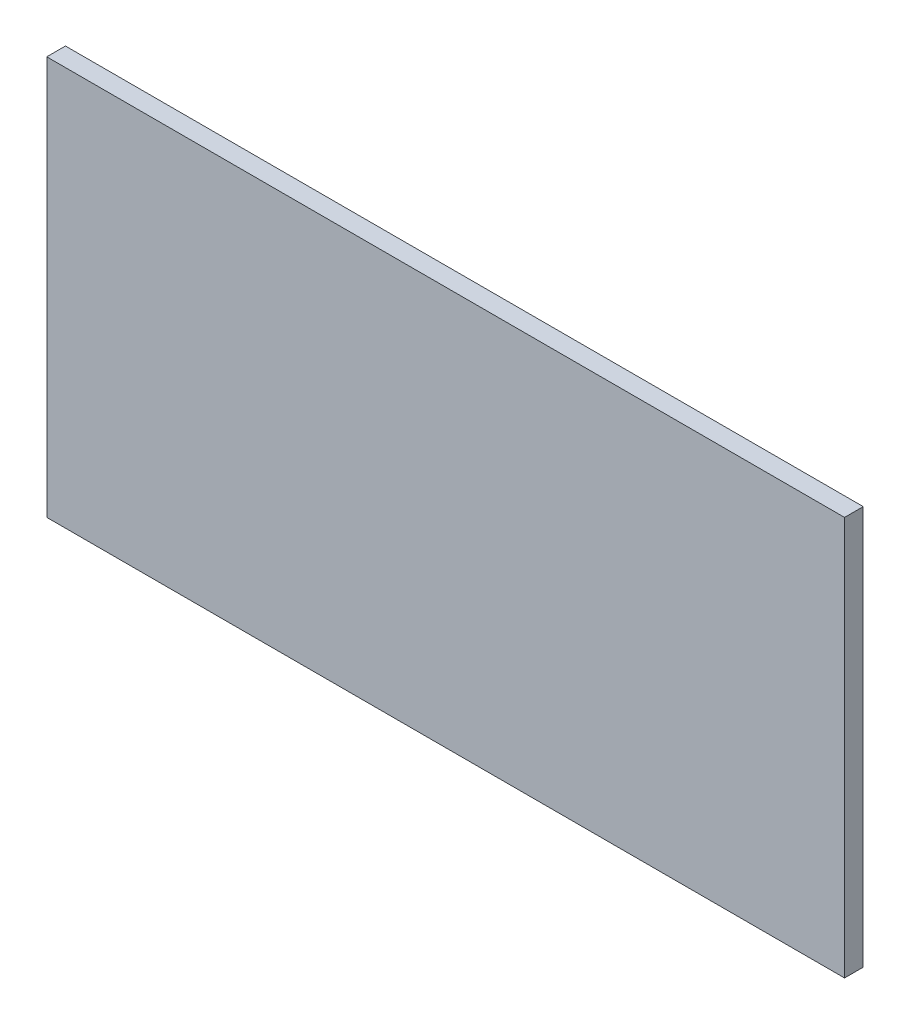
ISO-10303-21;
HEADER;
FILE_DESCRIPTION(('STEP AP214'),'2;1');
FILE_NAME('part.step','',(''),(''),'','','');
FILE_SCHEMA(('AUTOMOTIVE_DESIGN { 1 0 10303 214 1 1 1 1 }'));
ENDSEC;
DATA;
#1=APPLICATION_CONTEXT('core data for automotive mechanical design processes');
#2=APPLICATION_PROTOCOL_DEFINITION('international standard','automotive_design',2000,#1);
#3=PRODUCT_CONTEXT('',#1,'mechanical');
#4=PRODUCT('Part','Part','',(#3));
#5=PRODUCT_RELATED_PRODUCT_CATEGORY('part','',(#4));
#6=PRODUCT_DEFINITION_FORMATION('','',#4);
#7=PRODUCT_DEFINITION_CONTEXT('part definition',#1,'design');
#8=PRODUCT_DEFINITION('design','',#6,#7);
#9=PRODUCT_DEFINITION_SHAPE('','',#8);
#10=(LENGTH_UNIT() NAMED_UNIT(*) SI_UNIT(.MILLI.,.METRE.));
#11=(NAMED_UNIT(*) PLANE_ANGLE_UNIT() SI_UNIT($,.RADIAN.));
#12=(NAMED_UNIT(*) SI_UNIT($,.STERADIAN.) SOLID_ANGLE_UNIT());
#13=UNCERTAINTY_MEASURE_WITH_UNIT(LENGTH_MEASURE(1.E-05),#10,'distance_accuracy_value','');
#14=(GEOMETRIC_REPRESENTATION_CONTEXT(3) GLOBAL_UNCERTAINTY_ASSIGNED_CONTEXT((#13)) GLOBAL_UNIT_ASSIGNED_CONTEXT((#10,
#11,#12)) REPRESENTATION_CONTEXT('',''));
#15=CARTESIAN_POINT('',(0.,0.,0.));
#16=DIRECTION('',(0.,0.,1.));
#17=DIRECTION('',(1.,0.,0.));
#18=AXIS2_PLACEMENT_3D('',#15,#16,#17);
#19=CARTESIAN_POINT('',(64.,32.,3.));
#20=DIRECTION('',(-1.,0.,0.));
#21=DIRECTION('',(0.,0.,1.));
#22=AXIS2_PLACEMENT_3D('',#19,#20,#21);
#23=PLANE('',#22);
#24=DIRECTION('',(0.,1.,0.));
#25=VECTOR('',#24,1.);
#26=CARTESIAN_POINT('',(64.,32.,0.));
#27=LINE('',#26,#25);
#28=CARTESIAN_POINT('',(64.,-32.,0.));
#29=VERTEX_POINT('',#28);
#30=CARTESIAN_POINT('',(64.,32.,0.));
#31=VERTEX_POINT('',#30);
#32=EDGE_CURVE('E98',#29,#31,#27,.T.);
#33=ORIENTED_EDGE('',*,*,#32,.T.);
#34=DIRECTION('',(0.,0.,-1.));
#35=VECTOR('',#34,1.);
#36=CARTESIAN_POINT('',(64.,32.,3.));
#37=LINE('',#36,#35);
#38=CARTESIAN_POINT('',(64.,32.,3.));
#39=VERTEX_POINT('',#38);
#40=EDGE_CURVE('E11',#39,#31,#37,.T.);
#41=ORIENTED_EDGE('',*,*,#40,.F.);
#42=DIRECTION('',(0.,1.,0.));
#43=VECTOR('',#42,1.);
#44=CARTESIAN_POINT('',(64.,32.,3.));
#45=LINE('',#44,#43);
#46=CARTESIAN_POINT('',(64.,-32.,3.));
#47=VERTEX_POINT('',#46);
#48=EDGE_CURVE('E86',#47,#39,#45,.T.);
#49=ORIENTED_EDGE('',*,*,#48,.F.);
#50=DIRECTION('',(0.,0.,-1.));
#51=VECTOR('',#50,1.);
#52=CARTESIAN_POINT('',(64.,-32.,3.));
#53=LINE('',#52,#51);
#54=EDGE_CURVE('E94',#47,#29,#53,.T.);
#55=ORIENTED_EDGE('',*,*,#54,.T.);
#56=EDGE_LOOP('',(#33,#41,#49,#55));
#57=FACE_BOUND('',#56,.T.);
#58=ADVANCED_FACE('F35',(#57),#23,.F.);
#59=CARTESIAN_POINT('',(-64.,32.,3.));
#60=DIRECTION('',(0.,-1.,0.));
#61=DIRECTION('',(0.,0.,-1.));
#62=AXIS2_PLACEMENT_3D('',#59,#60,#61);
#63=PLANE('',#62);
#64=DIRECTION('',(-1.,0.,0.));
#65=VECTOR('',#64,1.);
#66=CARTESIAN_POINT('',(-64.,32.,0.));
#67=LINE('',#66,#65);
#68=CARTESIAN_POINT('',(-64.,32.,0.));
#69=VERTEX_POINT('',#68);
#70=EDGE_CURVE('E90',#31,#69,#67,.T.);
#71=ORIENTED_EDGE('',*,*,#70,.T.);
#72=DIRECTION('',(0.,0.,-1.));
#73=VECTOR('',#72,1.);
#74=CARTESIAN_POINT('',(-64.,32.,3.));
#75=LINE('',#74,#73);
#76=CARTESIAN_POINT('',(-64.,32.,3.));
#77=VERTEX_POINT('',#76);
#78=EDGE_CURVE('E43',#77,#69,#75,.T.);
#79=ORIENTED_EDGE('',*,*,#78,.F.);
#80=DIRECTION('',(-1.,0.,0.));
#81=VECTOR('',#80,1.);
#82=CARTESIAN_POINT('',(-64.,32.,3.));
#83=LINE('',#82,#81);
#84=EDGE_CURVE('E81',#39,#77,#83,.T.);
#85=ORIENTED_EDGE('',*,*,#84,.F.);
#86=ORIENTED_EDGE('',*,*,#40,.T.);
#87=EDGE_LOOP('',(#71,#79,#85,#86));
#88=FACE_BOUND('',#87,.T.);
#89=ADVANCED_FACE('F89',(#88),#63,.F.);
#90=CARTESIAN_POINT('',(-64.,32.,3.));
#91=DIRECTION('',(1.,0.,0.));
#92=DIRECTION('',(0.,0.,-1.));
#93=AXIS2_PLACEMENT_3D('',#90,#91,#92);
#94=PLANE('',#93);
#95=DIRECTION('',(0.,-1.,0.));
#96=VECTOR('',#95,1.);
#97=CARTESIAN_POINT('',(-64.,32.,0.));
#98=LINE('',#97,#96);
#99=CARTESIAN_POINT('',(-64.,-32.,0.));
#100=VERTEX_POINT('',#99);
#101=EDGE_CURVE('E68',#69,#100,#98,.T.);
#102=ORIENTED_EDGE('',*,*,#101,.T.);
#103=DIRECTION('',(0.,0.,-1.));
#104=VECTOR('',#103,1.);
#105=CARTESIAN_POINT('',(-64.,-32.,3.));
#106=LINE('',#105,#104);
#107=CARTESIAN_POINT('',(-64.,-32.,3.));
#108=VERTEX_POINT('',#107);
#109=EDGE_CURVE('E91',#108,#100,#106,.T.);
#110=ORIENTED_EDGE('',*,*,#109,.F.);
#111=DIRECTION('',(0.,-1.,0.));
#112=VECTOR('',#111,1.);
#113=CARTESIAN_POINT('',(-64.,32.,3.));
#114=LINE('',#113,#112);
#115=EDGE_CURVE('E84',#77,#108,#114,.T.);
#116=ORIENTED_EDGE('',*,*,#115,.F.);
#117=ORIENTED_EDGE('',*,*,#78,.T.);
#118=EDGE_LOOP('',(#102,#110,#116,#117));
#119=FACE_BOUND('',#118,.T.);
#120=ADVANCED_FACE('F92',(#119),#94,.F.);
#121=CARTESIAN_POINT('',(-64.,-32.,3.));
#122=DIRECTION('',(0.,1.,0.));
#123=DIRECTION('',(0.,0.,1.));
#124=AXIS2_PLACEMENT_3D('',#121,#122,#123);
#125=PLANE('',#124);
#126=DIRECTION('',(1.,0.,0.));
#127=VECTOR('',#126,1.);
#128=CARTESIAN_POINT('',(-64.,-32.,0.));
#129=LINE('',#128,#127);
#130=EDGE_CURVE('E74',#100,#29,#129,.T.);
#131=ORIENTED_EDGE('',*,*,#130,.T.);
#132=ORIENTED_EDGE('',*,*,#54,.F.);
#133=DIRECTION('',(1.,0.,0.));
#134=VECTOR('',#133,1.);
#135=CARTESIAN_POINT('',(-64.,-32.,3.));
#136=LINE('',#135,#134);
#137=EDGE_CURVE('E51',#108,#47,#136,.T.);
#138=ORIENTED_EDGE('',*,*,#137,.F.);
#139=ORIENTED_EDGE('',*,*,#109,.T.);
#140=EDGE_LOOP('',(#131,#132,#138,#139));
#141=FACE_BOUND('',#140,.T.);
#142=ADVANCED_FACE('F105',(#141),#125,.F.);
#143=CARTESIAN_POINT('',(0.,0.,3.));
#144=DIRECTION('',(0.,0.,1.));
#145=DIRECTION('',(1.,0.,0.));
#146=AXIS2_PLACEMENT_3D('',#143,#144,#145);
#147=PLANE('',#146);
#148=ORIENTED_EDGE('',*,*,#48,.T.);
#149=ORIENTED_EDGE('',*,*,#84,.T.);
#150=ORIENTED_EDGE('',*,*,#115,.T.);
#151=ORIENTED_EDGE('',*,*,#137,.T.);
#152=EDGE_LOOP('',(#148,#149,#150,#151));
#153=FACE_BOUND('',#152,.T.);
#154=ADVANCED_FACE('F82',(#153),#147,.T.);
#155=CARTESIAN_POINT('',(0.,0.,0.));
#156=DIRECTION('',(0.,0.,1.));
#157=DIRECTION('',(1.,0.,0.));
#158=AXIS2_PLACEMENT_3D('',#155,#156,#157);
#159=PLANE('',#158);
#160=ORIENTED_EDGE('',*,*,#32,.F.);
#161=ORIENTED_EDGE('',*,*,#130,.F.);
#162=ORIENTED_EDGE('',*,*,#101,.F.);
#163=ORIENTED_EDGE('',*,*,#70,.F.);
#164=EDGE_LOOP('',(#160,#161,#162,#163));
#165=FACE_BOUND('',#164,.T.);
#166=ADVANCED_FACE('F108',(#165),#159,.F.);
#167=CLOSED_SHELL('',(#58,#89,#120,#142,#154,#166));
#168=MANIFOLD_SOLID_BREP('B2',#167);
#169=ADVANCED_BREP_SHAPE_REPRESENTATION('',(#18,#168),#14);
#170=SHAPE_DEFINITION_REPRESENTATION(#9,#169);
ENDSEC;
END-ISO-10303-21;
